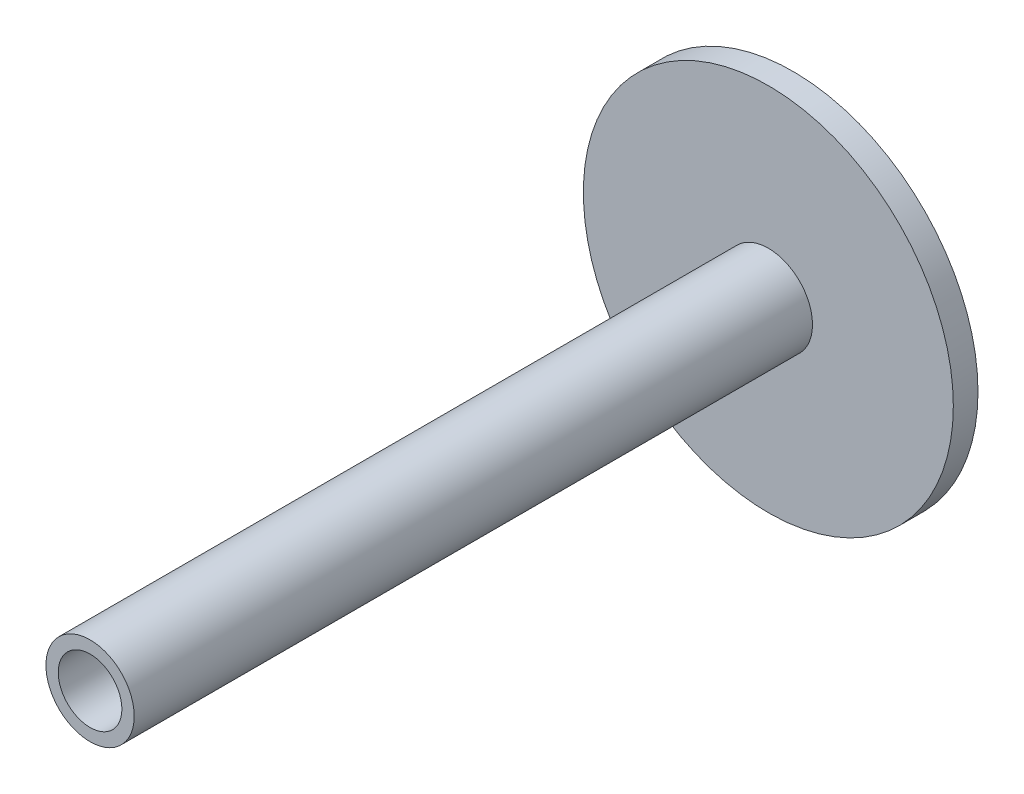
ISO-10303-21;
HEADER;
FILE_DESCRIPTION(('STEP AP214'),'2;1');
FILE_NAME('part.step','',(''),(''),'','','');
FILE_SCHEMA(('AUTOMOTIVE_DESIGN { 1 0 10303 214 1 1 1 1 }'));
ENDSEC;
DATA;
#1=APPLICATION_CONTEXT('core data for automotive mechanical design processes');
#2=APPLICATION_PROTOCOL_DEFINITION('international standard','automotive_design',2000,#1);
#3=PRODUCT_CONTEXT('',#1,'mechanical');
#4=PRODUCT('Part','Part','',(#3));
#5=PRODUCT_RELATED_PRODUCT_CATEGORY('part','',(#4));
#6=PRODUCT_DEFINITION_FORMATION('','',#4);
#7=PRODUCT_DEFINITION_CONTEXT('part definition',#1,'design');
#8=PRODUCT_DEFINITION('design','',#6,#7);
#9=PRODUCT_DEFINITION_SHAPE('','',#8);
#10=(LENGTH_UNIT() NAMED_UNIT(*) SI_UNIT(.MILLI.,.METRE.));
#11=(NAMED_UNIT(*) PLANE_ANGLE_UNIT() SI_UNIT($,.RADIAN.));
#12=(NAMED_UNIT(*) SI_UNIT($,.STERADIAN.) SOLID_ANGLE_UNIT());
#13=UNCERTAINTY_MEASURE_WITH_UNIT(LENGTH_MEASURE(1.E-05),#10,'distance_accuracy_value','');
#14=(GEOMETRIC_REPRESENTATION_CONTEXT(3) GLOBAL_UNCERTAINTY_ASSIGNED_CONTEXT((#13)) GLOBAL_UNIT_ASSIGNED_CONTEXT((#10,
#11,#12)) REPRESENTATION_CONTEXT('',''));
#15=CARTESIAN_POINT('',(0.,0.,0.));
#16=DIRECTION('',(0.,0.,1.));
#17=DIRECTION('',(1.,0.,0.));
#18=AXIS2_PLACEMENT_3D('',#15,#16,#17);
#19=CARTESIAN_POINT('',(0.,0.,2.));
#20=DIRECTION('',(0.,0.,1.));
#21=DIRECTION('',(1.,0.,0.));
#22=AXIS2_PLACEMENT_3D('',#19,#20,#21);
#23=PLANE('',#22);
#24=CARTESIAN_POINT('',(0.,0.,2.));
#25=DIRECTION('',(0.,0.,1.));
#26=DIRECTION('',(1.,0.,0.));
#27=AXIS2_PLACEMENT_3D('',#24,#25,#26);
#28=CIRCLE('',#27,15.);
#29=CARTESIAN_POINT('',(15.,0.,2.));
#30=VERTEX_POINT('',#29);
#31=EDGE_CURVE('E10',#30,#30,#28,.T.);
#32=ORIENTED_EDGE('',*,*,#31,.T.);
#33=EDGE_LOOP('',(#32));
#34=FACE_BOUND('',#33,.T.);
#35=CARTESIAN_POINT('',(0.,0.,2.));
#36=DIRECTION('',(0.,0.,1.));
#37=DIRECTION('',(1.,0.,0.));
#38=AXIS2_PLACEMENT_3D('',#35,#36,#37);
#39=CIRCLE('',#38,3.58);
#40=CARTESIAN_POINT('',(3.58,0.,2.));
#41=VERTEX_POINT('',#40);
#42=EDGE_CURVE('E48',#41,#41,#39,.T.);
#43=ORIENTED_EDGE('',*,*,#42,.F.);
#44=EDGE_LOOP('',(#43));
#45=FACE_BOUND('',#44,.T.);
#46=ADVANCED_FACE('F33',(#34,#45),#23,.T.);
#47=CARTESIAN_POINT('',(0.,0.,2.));
#48=DIRECTION('',(0.,0.,-1.));
#49=DIRECTION('',(-1.,0.,0.));
#50=AXIS2_PLACEMENT_3D('',#47,#48,#49);
#51=CYLINDRICAL_SURFACE('',#50,15.);
#52=ORIENTED_EDGE('',*,*,#31,.F.);
#53=EDGE_LOOP('',(#52));
#54=FACE_BOUND('',#53,.T.);
#55=CARTESIAN_POINT('',(0.,0.,0.));
#56=DIRECTION('',(0.,0.,1.));
#57=DIRECTION('',(1.,0.,0.));
#58=AXIS2_PLACEMENT_3D('',#55,#56,#57);
#59=CIRCLE('',#58,15.);
#60=CARTESIAN_POINT('',(15.,0.,0.));
#61=VERTEX_POINT('',#60);
#62=EDGE_CURVE('E41',#61,#61,#59,.T.);
#63=ORIENTED_EDGE('',*,*,#62,.T.);
#64=EDGE_LOOP('',(#63));
#65=FACE_BOUND('',#64,.T.);
#66=ADVANCED_FACE('F35',(#54,#65),#51,.T.);
#67=CARTESIAN_POINT('',(0.,0.,0.));
#68=DIRECTION('',(0.,0.,1.));
#69=DIRECTION('',(1.,0.,0.));
#70=AXIS2_PLACEMENT_3D('',#67,#68,#69);
#71=PLANE('',#70);
#72=CARTESIAN_POINT('',(0.,0.,0.));
#73=DIRECTION('',(0.,0.,1.));
#74=DIRECTION('',(1.,0.,0.));
#75=AXIS2_PLACEMENT_3D('',#72,#73,#74);
#76=CIRCLE('',#75,2.58);
#77=CARTESIAN_POINT('',(2.58,0.,0.));
#78=VERTEX_POINT('',#77);
#79=EDGE_CURVE('E37',#78,#78,#76,.T.);
#80=ORIENTED_EDGE('',*,*,#79,.T.);
#81=EDGE_LOOP('',(#80));
#82=FACE_BOUND('',#81,.T.);
#83=ORIENTED_EDGE('',*,*,#62,.F.);
#84=EDGE_LOOP('',(#83));
#85=FACE_BOUND('',#84,.T.);
#86=ADVANCED_FACE('F60',(#82,#85),#71,.F.);
#87=CARTESIAN_POINT('',(0.,0.,57.));
#88=DIRECTION('',(0.,0.,1.));
#89=DIRECTION('',(1.,0.,0.));
#90=AXIS2_PLACEMENT_3D('',#87,#88,#89);
#91=PLANE('',#90);
#92=CARTESIAN_POINT('',(0.,0.,57.));
#93=DIRECTION('',(0.,0.,1.));
#94=DIRECTION('',(1.,0.,0.));
#95=AXIS2_PLACEMENT_3D('',#92,#93,#94);
#96=CIRCLE('',#95,3.58);
#97=CARTESIAN_POINT('',(3.58,0.,57.));
#98=VERTEX_POINT('',#97);
#99=EDGE_CURVE('E46',#98,#98,#96,.T.);
#100=ORIENTED_EDGE('',*,*,#99,.T.);
#101=EDGE_LOOP('',(#100));
#102=FACE_BOUND('',#101,.T.);
#103=CARTESIAN_POINT('',(0.,0.,57.));
#104=DIRECTION('',(0.,0.,1.));
#105=DIRECTION('',(1.,0.,0.));
#106=AXIS2_PLACEMENT_3D('',#103,#104,#105);
#107=CIRCLE('',#106,2.58);
#108=CARTESIAN_POINT('',(2.58,0.,57.));
#109=VERTEX_POINT('',#108);
#110=EDGE_CURVE('E51',#109,#109,#107,.T.);
#111=ORIENTED_EDGE('',*,*,#110,.F.);
#112=EDGE_LOOP('',(#111));
#113=FACE_BOUND('',#112,.T.);
#114=ADVANCED_FACE('F70',(#102,#113),#91,.T.);
#115=CARTESIAN_POINT('',(0.,0.,57.));
#116=DIRECTION('',(0.,0.,-1.));
#117=DIRECTION('',(-1.,0.,0.));
#118=AXIS2_PLACEMENT_3D('',#115,#116,#117);
#119=CYLINDRICAL_SURFACE('',#118,3.58);
#120=ORIENTED_EDGE('',*,*,#99,.F.);
#121=EDGE_LOOP('',(#120));
#122=FACE_BOUND('',#121,.T.);
#123=ORIENTED_EDGE('',*,*,#42,.T.);
#124=EDGE_LOOP('',(#123));
#125=FACE_BOUND('',#124,.T.);
#126=ADVANCED_FACE('F65',(#122,#125),#119,.T.);
#127=CARTESIAN_POINT('',(0.,0.,57.));
#128=DIRECTION('',(0.,0.,-1.));
#129=DIRECTION('',(-1.,0.,0.));
#130=AXIS2_PLACEMENT_3D('',#127,#128,#129);
#131=CYLINDRICAL_SURFACE('',#130,2.58);
#132=ORIENTED_EDGE('',*,*,#110,.T.);
#133=EDGE_LOOP('',(#132));
#134=FACE_BOUND('',#133,.T.);
#135=ORIENTED_EDGE('',*,*,#79,.F.);
#136=EDGE_LOOP('',(#135));
#137=FACE_BOUND('',#136,.T.);
#138=ADVANCED_FACE('F63',(#134,#137),#131,.F.);
#139=CLOSED_SHELL('',(#46,#66,#86,#114,#126,#138));
#140=MANIFOLD_SOLID_BREP('B2',#139);
#141=ADVANCED_BREP_SHAPE_REPRESENTATION('',(#18,#140),#14);
#142=SHAPE_DEFINITION_REPRESENTATION(#9,#141);
ENDSEC;
END-ISO-10303-21;
